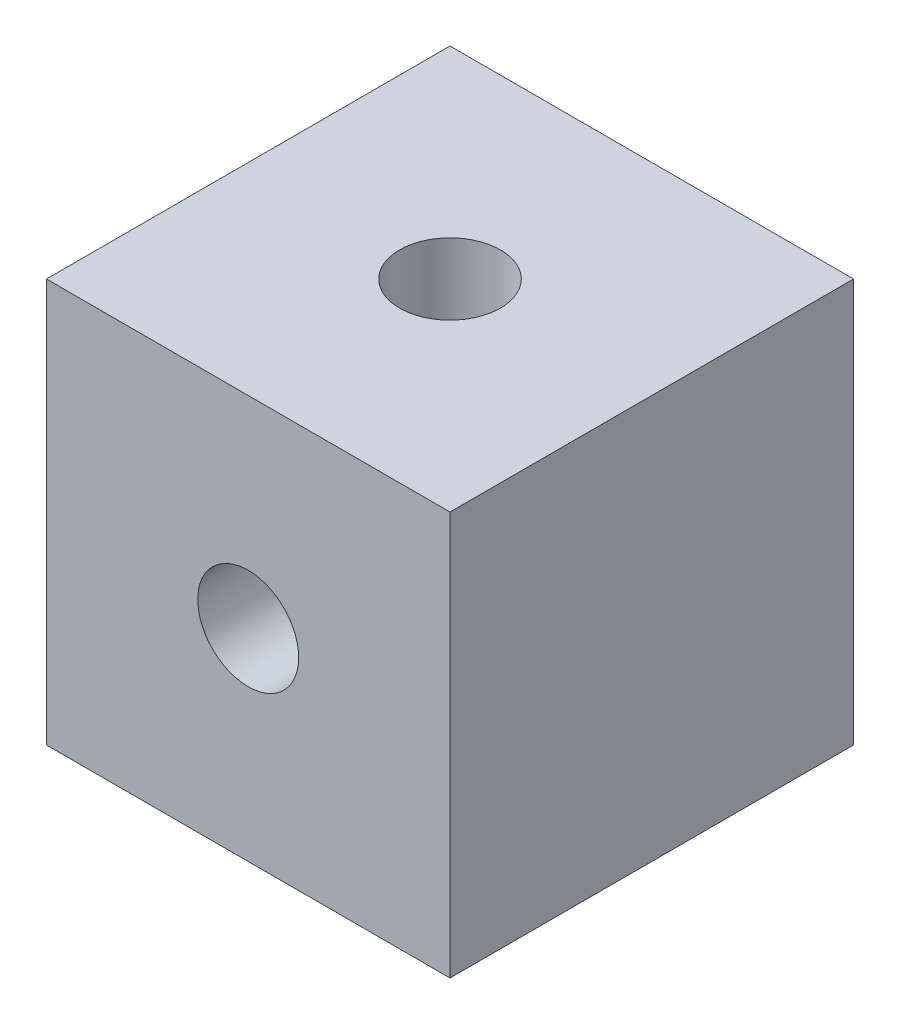
ISO-10303-21;
HEADER;
FILE_DESCRIPTION(('STEP AP214'),'2;1');
FILE_NAME('part.step','',(''),(''),'','','');
FILE_SCHEMA(('AUTOMOTIVE_DESIGN { 1 0 10303 214 1 1 1 1 }'));
ENDSEC;
DATA;
#1=APPLICATION_CONTEXT('core data for automotive mechanical design processes');
#2=APPLICATION_PROTOCOL_DEFINITION('international standard','automotive_design',2000,#1);
#3=PRODUCT_CONTEXT('',#1,'mechanical');
#4=PRODUCT('Part','Part','',(#3));
#5=PRODUCT_RELATED_PRODUCT_CATEGORY('part','',(#4));
#6=PRODUCT_DEFINITION_FORMATION('','',#4);
#7=PRODUCT_DEFINITION_CONTEXT('part definition',#1,'design');
#8=PRODUCT_DEFINITION('design','',#6,#7);
#9=PRODUCT_DEFINITION_SHAPE('','',#8);
#10=(LENGTH_UNIT() NAMED_UNIT(*) SI_UNIT(.MILLI.,.METRE.));
#11=(NAMED_UNIT(*) PLANE_ANGLE_UNIT() SI_UNIT($,.RADIAN.));
#12=(NAMED_UNIT(*) SI_UNIT($,.STERADIAN.) SOLID_ANGLE_UNIT());
#13=UNCERTAINTY_MEASURE_WITH_UNIT(LENGTH_MEASURE(1.E-05),#10,'distance_accuracy_value','');
#14=(GEOMETRIC_REPRESENTATION_CONTEXT(3) GLOBAL_UNCERTAINTY_ASSIGNED_CONTEXT((#13)) GLOBAL_UNIT_ASSIGNED_CONTEXT((#10,
#11,#12)) REPRESENTATION_CONTEXT('',''));
#15=CARTESIAN_POINT('',(0.,0.,0.));
#16=DIRECTION('',(0.,0.,1.));
#17=DIRECTION('',(1.,0.,0.));
#18=AXIS2_PLACEMENT_3D('',#15,#16,#17);
#19=CARTESIAN_POINT('',(0.,0.,12.7));
#20=DIRECTION('',(0.,0.,1.));
#21=DIRECTION('',(1.,0.,0.));
#22=AXIS2_PLACEMENT_3D('',#19,#20,#21);
#23=PLANE('',#22);
#24=CARTESIAN_POINT('',(0.,0.,12.7));
#25=DIRECTION('',(0.,0.,1.));
#26=DIRECTION('',(1.,0.,0.));
#27=AXIS2_PLACEMENT_3D('',#24,#25,#26);
#28=CIRCLE('',#27,3.175);
#29=CARTESIAN_POINT('',(-3.175,0.,12.7));
#30=VERTEX_POINT('',#29);
#31=CARTESIAN_POINT('',(3.175,0.,12.7));
#32=VERTEX_POINT('',#31);
#33=EDGE_CURVE('E100',#30,#32,#28,.T.);
#34=ORIENTED_EDGE('',*,*,#33,.T.);
#35=DIRECTION('',(-1.,0.,0.));
#36=VECTOR('',#35,1.);
#37=CARTESIAN_POINT('',(0.,0.,12.7));
#38=LINE('',#37,#36);
#39=EDGE_CURVE('E11',#32,#30,#38,.T.);
#40=ORIENTED_EDGE('',*,*,#39,.T.);
#41=EDGE_LOOP('',(#34,#40));
#42=FACE_BOUND('',#41,.T.);
#43=ADVANCED_FACE('F33',(#42),#23,.T.);
#44=CARTESIAN_POINT('',(-12.7,-12.7,25.4));
#45=DIRECTION('',(1.,0.,0.));
#46=DIRECTION('',(0.,0.,-1.));
#47=AXIS2_PLACEMENT_3D('',#44,#45,#46);
#48=PLANE('',#47);
#49=DIRECTION('',(0.,-1.,0.));
#50=VECTOR('',#49,1.);
#51=CARTESIAN_POINT('',(-12.7,-12.7,0.));
#52=LINE('',#51,#50);
#53=CARTESIAN_POINT('',(-12.7,12.7,0.));
#54=VERTEX_POINT('',#53);
#55=CARTESIAN_POINT('',(-12.7,-12.7,0.));
#56=VERTEX_POINT('',#55);
#57=EDGE_CURVE('E103',#54,#56,#52,.T.);
#58=ORIENTED_EDGE('',*,*,#57,.T.);
#59=DIRECTION('',(0.,0.,-1.));
#60=VECTOR('',#59,1.);
#61=CARTESIAN_POINT('',(-12.7,-12.7,25.4));
#62=LINE('',#61,#60);
#63=CARTESIAN_POINT('',(-12.7,-12.7,25.4));
#64=VERTEX_POINT('',#63);
#65=EDGE_CURVE('E41',#64,#56,#62,.T.);
#66=ORIENTED_EDGE('',*,*,#65,.F.);
#67=DIRECTION('',(0.,-1.,0.));
#68=VECTOR('',#67,1.);
#69=CARTESIAN_POINT('',(-12.7,-12.7,25.4));
#70=LINE('',#69,#68);
#71=CARTESIAN_POINT('',(-12.7,12.7,25.4));
#72=VERTEX_POINT('',#71);
#73=EDGE_CURVE('E112',#72,#64,#70,.T.);
#74=ORIENTED_EDGE('',*,*,#73,.F.);
#75=DIRECTION('',(0.,0.,-1.));
#76=VECTOR('',#75,1.);
#77=CARTESIAN_POINT('',(-12.7,12.7,25.4));
#78=LINE('',#77,#76);
#79=EDGE_CURVE('E117',#72,#54,#78,.T.);
#80=ORIENTED_EDGE('',*,*,#79,.T.);
#81=EDGE_LOOP('',(#58,#66,#74,#80));
#82=FACE_BOUND('',#81,.T.);
#83=ADVANCED_FACE('F35',(#82),#48,.F.);
#84=CARTESIAN_POINT('',(12.7,-12.7,25.4));
#85=DIRECTION('',(0.,1.,0.));
#86=DIRECTION('',(-1.,0.,0.));
#87=AXIS2_PLACEMENT_3D('',#84,#85,#86);
#88=PLANE('',#87);
#89=DIRECTION('',(1.,0.,0.));
#90=VECTOR('',#89,1.);
#91=CARTESIAN_POINT('',(12.7,-12.7,0.));
#92=LINE('',#91,#90);
#93=CARTESIAN_POINT('',(12.7,-12.7,0.));
#94=VERTEX_POINT('',#93);
#95=EDGE_CURVE('E106',#56,#94,#92,.T.);
#96=ORIENTED_EDGE('',*,*,#95,.T.);
#97=DIRECTION('',(0.,0.,-1.));
#98=VECTOR('',#97,1.);
#99=CARTESIAN_POINT('',(12.7,-12.7,25.4));
#100=LINE('',#99,#98);
#101=CARTESIAN_POINT('',(12.7,-12.7,25.4));
#102=VERTEX_POINT('',#101);
#103=EDGE_CURVE('E126',#102,#94,#100,.T.);
#104=ORIENTED_EDGE('',*,*,#103,.F.);
#105=DIRECTION('',(1.,0.,0.));
#106=VECTOR('',#105,1.);
#107=CARTESIAN_POINT('',(12.7,-12.7,25.4));
#108=LINE('',#107,#106);
#109=EDGE_CURVE('E85',#64,#102,#108,.T.);
#110=ORIENTED_EDGE('',*,*,#109,.F.);
#111=ORIENTED_EDGE('',*,*,#65,.T.);
#112=EDGE_LOOP('',(#96,#104,#110,#111));
#113=FACE_BOUND('',#112,.T.);
#114=ADVANCED_FACE('F129',(#113),#88,.F.);
#115=CARTESIAN_POINT('',(12.7,-12.7,25.4));
#116=DIRECTION('',(-1.,0.,0.));
#117=DIRECTION('',(0.,0.,1.));
#118=AXIS2_PLACEMENT_3D('',#115,#116,#117);
#119=PLANE('',#118);
#120=DIRECTION('',(0.,1.,0.));
#121=VECTOR('',#120,1.);
#122=CARTESIAN_POINT('',(12.7,-12.7,0.));
#123=LINE('',#122,#121);
#124=CARTESIAN_POINT('',(12.7,12.7,0.));
#125=VERTEX_POINT('',#124);
#126=EDGE_CURVE('E120',#94,#125,#123,.T.);
#127=ORIENTED_EDGE('',*,*,#126,.T.);
#128=DIRECTION('',(0.,0.,-1.));
#129=VECTOR('',#128,1.);
#130=CARTESIAN_POINT('',(12.7,12.7,25.4));
#131=LINE('',#130,#129);
#132=CARTESIAN_POINT('',(12.7,12.7,25.4));
#133=VERTEX_POINT('',#132);
#134=EDGE_CURVE('E124',#133,#125,#131,.T.);
#135=ORIENTED_EDGE('',*,*,#134,.F.);
#136=DIRECTION('',(0.,1.,0.));
#137=VECTOR('',#136,1.);
#138=CARTESIAN_POINT('',(12.7,-12.7,25.4));
#139=LINE('',#138,#137);
#140=EDGE_CURVE('E115',#102,#133,#139,.T.);
#141=ORIENTED_EDGE('',*,*,#140,.F.);
#142=ORIENTED_EDGE('',*,*,#103,.T.);
#143=EDGE_LOOP('',(#127,#135,#141,#142));
#144=FACE_BOUND('',#143,.T.);
#145=ADVANCED_FACE('F138',(#144),#119,.F.);
#146=CARTESIAN_POINT('',(12.7,12.7,25.4));
#147=DIRECTION('',(0.,-1.,0.));
#148=DIRECTION('',(1.,0.,0.));
#149=AXIS2_PLACEMENT_3D('',#146,#147,#148);
#150=PLANE('',#149);
#151=CARTESIAN_POINT('',(0.,12.7,12.7));
#152=DIRECTION('',(0.,1.,0.));
#153=DIRECTION('',(-1.,0.,0.));
#154=AXIS2_PLACEMENT_3D('',#151,#152,#153);
#155=CIRCLE('',#154,3.175);
#156=CARTESIAN_POINT('',(-3.175,12.7,12.7));
#157=VERTEX_POINT('',#156);
#158=EDGE_CURVE('E95',#157,#157,#155,.T.);
#159=ORIENTED_EDGE('',*,*,#158,.F.);
#160=EDGE_LOOP('',(#159));
#161=FACE_BOUND('',#160,.T.);
#162=DIRECTION('',(-1.,0.,0.));
#163=VECTOR('',#162,1.);
#164=CARTESIAN_POINT('',(12.7,12.7,0.));
#165=LINE('',#164,#163);
#166=EDGE_CURVE('E77',#125,#54,#165,.T.);
#167=ORIENTED_EDGE('',*,*,#166,.T.);
#168=ORIENTED_EDGE('',*,*,#79,.F.);
#169=DIRECTION('',(-1.,0.,0.));
#170=VECTOR('',#169,1.);
#171=CARTESIAN_POINT('',(12.7,12.7,25.4));
#172=LINE('',#171,#170);
#173=EDGE_CURVE('E56',#133,#72,#172,.T.);
#174=ORIENTED_EDGE('',*,*,#173,.F.);
#175=ORIENTED_EDGE('',*,*,#134,.T.);
#176=EDGE_LOOP('',(#167,#168,#174,#175));
#177=FACE_BOUND('',#176,.T.);
#178=ADVANCED_FACE('F140',(#161,#177),#150,.F.);
#179=CARTESIAN_POINT('',(0.,0.,25.4));
#180=DIRECTION('',(0.,0.,1.));
#181=DIRECTION('',(1.,0.,0.));
#182=AXIS2_PLACEMENT_3D('',#179,#180,#181);
#183=PLANE('',#182);
#184=CARTESIAN_POINT('',(0.,0.,25.4));
#185=DIRECTION('',(0.,0.,1.));
#186=DIRECTION('',(1.,0.,0.));
#187=AXIS2_PLACEMENT_3D('',#184,#185,#186);
#188=CIRCLE('',#187,3.175);
#189=CARTESIAN_POINT('',(3.175,0.,25.4));
#190=VERTEX_POINT('',#189);
#191=EDGE_CURVE('E101',#190,#190,#188,.T.);
#192=ORIENTED_EDGE('',*,*,#191,.F.);
#193=EDGE_LOOP('',(#192));
#194=FACE_BOUND('',#193,.T.);
#195=ORIENTED_EDGE('',*,*,#73,.T.);
#196=ORIENTED_EDGE('',*,*,#109,.T.);
#197=ORIENTED_EDGE('',*,*,#140,.T.);
#198=ORIENTED_EDGE('',*,*,#173,.T.);
#199=EDGE_LOOP('',(#195,#196,#197,#198));
#200=FACE_BOUND('',#199,.T.);
#201=ADVANCED_FACE('F141',(#194,#200),#183,.T.);
#202=CARTESIAN_POINT('',(0.,0.,0.));
#203=DIRECTION('',(0.,0.,1.));
#204=DIRECTION('',(1.,0.,0.));
#205=AXIS2_PLACEMENT_3D('',#202,#203,#204);
#206=PLANE('',#205);
#207=ORIENTED_EDGE('',*,*,#57,.F.);
#208=ORIENTED_EDGE('',*,*,#166,.F.);
#209=ORIENTED_EDGE('',*,*,#126,.F.);
#210=ORIENTED_EDGE('',*,*,#95,.F.);
#211=EDGE_LOOP('',(#207,#208,#209,#210));
#212=FACE_BOUND('',#211,.T.);
#213=ADVANCED_FACE('F134',(#212),#206,.F.);
#214=CARTESIAN_POINT('',(0.,0.,12.7));
#215=DIRECTION('',(0.,0.,1.));
#216=DIRECTION('',(1.,0.,0.));
#217=AXIS2_PLACEMENT_3D('',#214,#215,#216);
#218=CYLINDRICAL_SURFACE('',#217,3.175);
#219=ORIENTED_EDGE('',*,*,#33,.F.);
#220=CARTESIAN_POINT('',(0.,0.,12.7));
#221=DIRECTION('',(0.,-0.707106781186547,0.707106781186547));
#222=DIRECTION('',(0.,0.707106781186547,0.707106781186547));
#223=AXIS2_PLACEMENT_3D('',#220,#221,#222);
#224=ELLIPSE('',#223,4.49012806053458,3.175);
#225=EDGE_CURVE('E94',#30,#32,#224,.F.);
#226=ORIENTED_EDGE('',*,*,#225,.T.);
#227=EDGE_LOOP('',(#219,#226));
#228=FACE_BOUND('',#227,.T.);
#229=ORIENTED_EDGE('',*,*,#191,.T.);
#230=EDGE_LOOP('',(#229));
#231=FACE_BOUND('',#230,.T.);
#232=ADVANCED_FACE('F98',(#228,#231),#218,.F.);
#233=CARTESIAN_POINT('',(0.,0.,12.7));
#234=DIRECTION('',(0.,1.,0.));
#235=DIRECTION('',(-1.,0.,0.));
#236=AXIS2_PLACEMENT_3D('',#233,#234,#235);
#237=CYLINDRICAL_SURFACE('',#236,3.175);
#238=ORIENTED_EDGE('',*,*,#158,.T.);
#239=EDGE_LOOP('',(#238));
#240=FACE_BOUND('',#239,.T.);
#241=CARTESIAN_POINT('',(0.,0.,12.7));
#242=DIRECTION('',(0.,1.,0.));
#243=DIRECTION('',(-1.,0.,0.));
#244=AXIS2_PLACEMENT_3D('',#241,#242,#243);
#245=CIRCLE('',#244,3.175);
#246=EDGE_CURVE('E47',#32,#30,#245,.T.);
#247=ORIENTED_EDGE('',*,*,#246,.F.);
#248=ORIENTED_EDGE('',*,*,#225,.F.);
#249=EDGE_LOOP('',(#247,#248));
#250=FACE_BOUND('',#249,.T.);
#251=ADVANCED_FACE('F93',(#240,#250),#237,.F.);
#252=CARTESIAN_POINT('',(0.,0.,12.7));
#253=DIRECTION('',(0.,1.,0.));
#254=DIRECTION('',(-1.,0.,0.));
#255=AXIS2_PLACEMENT_3D('',#252,#253,#254);
#256=PLANE('',#255);
#257=ORIENTED_EDGE('',*,*,#246,.T.);
#258=ORIENTED_EDGE('',*,*,#39,.F.);
#259=EDGE_LOOP('',(#257,#258));
#260=FACE_BOUND('',#259,.T.);
#261=ADVANCED_FACE('F87',(#260),#256,.T.);
#262=CLOSED_SHELL('',(#43,#83,#114,#145,#178,#201,#213,#232,#251,#261));
#263=MANIFOLD_SOLID_BREP('B2',#262);
#264=ADVANCED_BREP_SHAPE_REPRESENTATION('',(#18,#263),#14);
#265=SHAPE_DEFINITION_REPRESENTATION(#9,#264);
ENDSEC;
END-ISO-10303-21;
